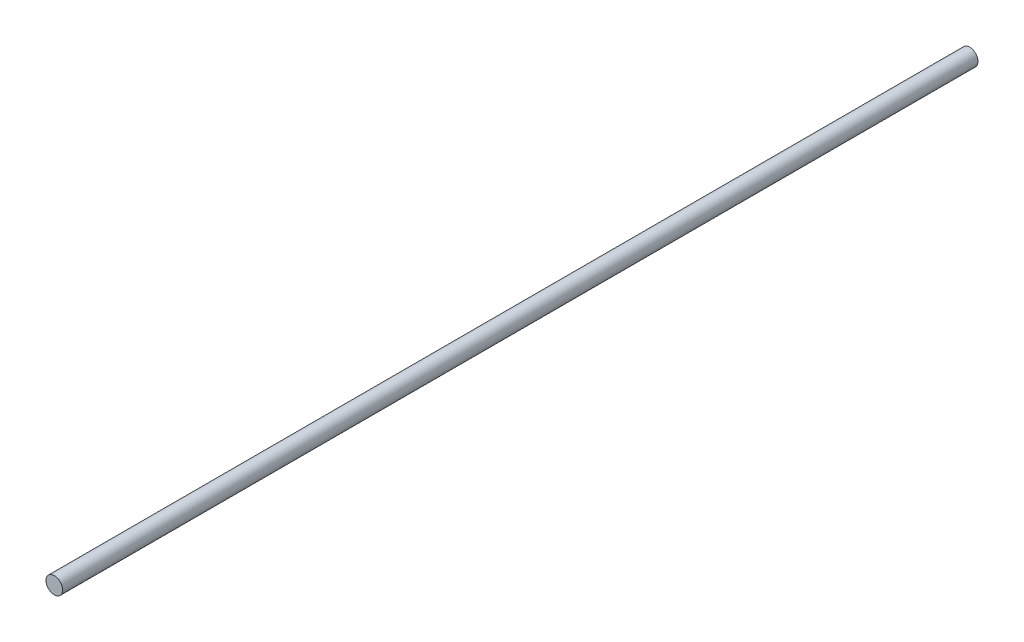
ISO-10303-21;
HEADER;
FILE_DESCRIPTION(('STEP AP214'),'2;1');
FILE_NAME('part.step','',(''),(''),'','','');
FILE_SCHEMA(('AUTOMOTIVE_DESIGN { 1 0 10303 214 1 1 1 1 }'));
ENDSEC;
DATA;
#1=APPLICATION_CONTEXT('core data for automotive mechanical design processes');
#2=APPLICATION_PROTOCOL_DEFINITION('international standard','automotive_design',2000,#1);
#3=PRODUCT_CONTEXT('',#1,'mechanical');
#4=PRODUCT('Part','Part','',(#3));
#5=PRODUCT_RELATED_PRODUCT_CATEGORY('part','',(#4));
#6=PRODUCT_DEFINITION_FORMATION('','',#4);
#7=PRODUCT_DEFINITION_CONTEXT('part definition',#1,'design');
#8=PRODUCT_DEFINITION('design','',#6,#7);
#9=PRODUCT_DEFINITION_SHAPE('','',#8);
#10=(LENGTH_UNIT() NAMED_UNIT(*) SI_UNIT(.MILLI.,.METRE.));
#11=(NAMED_UNIT(*) PLANE_ANGLE_UNIT() SI_UNIT($,.RADIAN.));
#12=(NAMED_UNIT(*) SI_UNIT($,.STERADIAN.) SOLID_ANGLE_UNIT());
#13=UNCERTAINTY_MEASURE_WITH_UNIT(LENGTH_MEASURE(1.E-05),#10,'distance_accuracy_value','');
#14=(GEOMETRIC_REPRESENTATION_CONTEXT(3) GLOBAL_UNCERTAINTY_ASSIGNED_CONTEXT((#13)) GLOBAL_UNIT_ASSIGNED_CONTEXT((#10,
#11,#12)) REPRESENTATION_CONTEXT('',''));
#15=CARTESIAN_POINT('',(0.,0.,0.));
#16=DIRECTION('',(0.,0.,1.));
#17=DIRECTION('',(1.,0.,0.));
#18=AXIS2_PLACEMENT_3D('',#15,#16,#17);
#19=CARTESIAN_POINT('',(0.,0.,1100.));
#20=DIRECTION('',(0.,0.,-1.));
#21=DIRECTION('',(-1.,0.,0.));
#22=AXIS2_PLACEMENT_3D('',#19,#20,#21);
#23=CYLINDRICAL_SURFACE('',#22,10.);
#24=CARTESIAN_POINT('',(0.,0.,1100.));
#25=DIRECTION('',(0.,0.,1.));
#26=DIRECTION('',(1.,0.,0.));
#27=AXIS2_PLACEMENT_3D('',#24,#25,#26);
#28=CIRCLE('',#27,10.);
#29=CARTESIAN_POINT('',(10.,0.,1100.));
#30=VERTEX_POINT('',#29);
#31=EDGE_CURVE('E10',#30,#30,#28,.T.);
#32=ORIENTED_EDGE('',*,*,#31,.F.);
#33=EDGE_LOOP('',(#32));
#34=FACE_BOUND('',#33,.T.);
#35=CARTESIAN_POINT('',(0.,0.,0.));
#36=DIRECTION('',(0.,0.,1.));
#37=DIRECTION('',(1.,0.,0.));
#38=AXIS2_PLACEMENT_3D('',#35,#36,#37);
#39=CIRCLE('',#38,10.);
#40=CARTESIAN_POINT('',(10.,0.,0.));
#41=VERTEX_POINT('',#40);
#42=EDGE_CURVE('E35',#41,#41,#39,.T.);
#43=ORIENTED_EDGE('',*,*,#42,.T.);
#44=EDGE_LOOP('',(#43));
#45=FACE_BOUND('',#44,.T.);
#46=ADVANCED_FACE('F32',(#34,#45),#23,.T.);
#47=CARTESIAN_POINT('',(0.,0.,1100.));
#48=DIRECTION('',(0.,0.,1.));
#49=DIRECTION('',(1.,0.,0.));
#50=AXIS2_PLACEMENT_3D('',#47,#48,#49);
#51=PLANE('',#50);
#52=ORIENTED_EDGE('',*,*,#31,.T.);
#53=EDGE_LOOP('',(#52));
#54=FACE_BOUND('',#53,.T.);
#55=ADVANCED_FACE('F47',(#54),#51,.T.);
#56=CARTESIAN_POINT('',(0.,0.,0.));
#57=DIRECTION('',(0.,0.,1.));
#58=DIRECTION('',(1.,0.,0.));
#59=AXIS2_PLACEMENT_3D('',#56,#57,#58);
#60=PLANE('',#59);
#61=ORIENTED_EDGE('',*,*,#42,.F.);
#62=EDGE_LOOP('',(#61));
#63=FACE_BOUND('',#62,.T.);
#64=ADVANCED_FACE('F45',(#63),#60,.F.);
#65=CLOSED_SHELL('',(#46,#55,#64));
#66=MANIFOLD_SOLID_BREP('B2',#65);
#67=ADVANCED_BREP_SHAPE_REPRESENTATION('',(#18,#66),#14);
#68=SHAPE_DEFINITION_REPRESENTATION(#9,#67);
ENDSEC;
END-ISO-10303-21;
